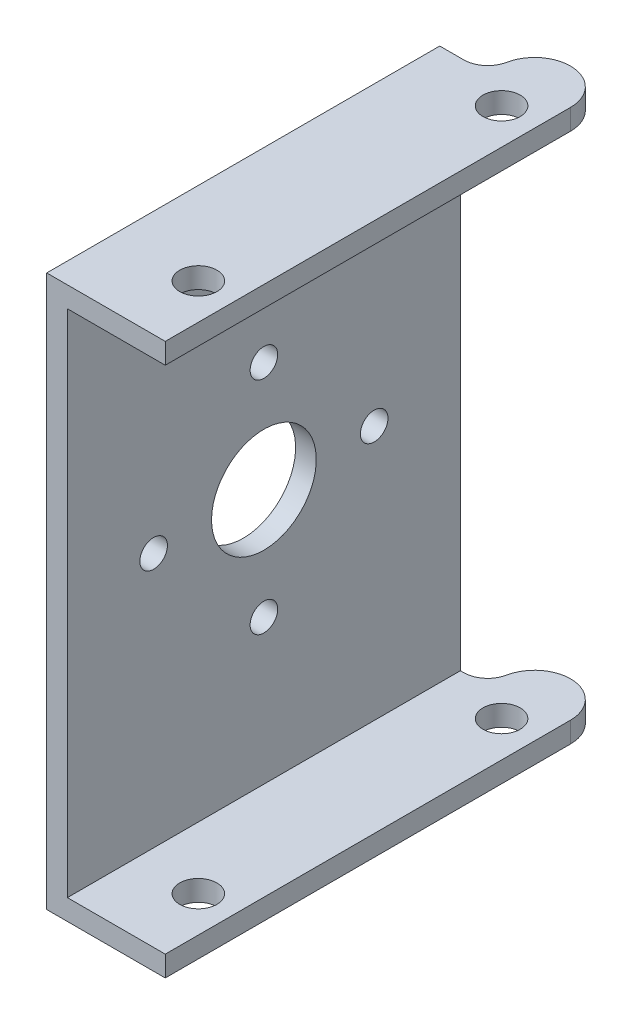
ISO-10303-21;
HEADER;
FILE_DESCRIPTION(('STEP AP214'),'2;1');
FILE_NAME('part.step','',(''),(''),'','','');
FILE_SCHEMA(('AUTOMOTIVE_DESIGN { 1 0 10303 214 1 1 1 1 }'));
ENDSEC;
DATA;
#1=APPLICATION_CONTEXT('core data for automotive mechanical design processes');
#2=APPLICATION_PROTOCOL_DEFINITION('international standard','automotive_design',2000,#1);
#3=PRODUCT_CONTEXT('',#1,'mechanical');
#4=PRODUCT('Part','Part','',(#3));
#5=PRODUCT_RELATED_PRODUCT_CATEGORY('part','',(#4));
#6=PRODUCT_DEFINITION_FORMATION('','',#4);
#7=PRODUCT_DEFINITION_CONTEXT('part definition',#1,'design');
#8=PRODUCT_DEFINITION('design','',#6,#7);
#9=PRODUCT_DEFINITION_SHAPE('','',#8);
#10=(LENGTH_UNIT() NAMED_UNIT(*) SI_UNIT(.MILLI.,.METRE.));
#11=(NAMED_UNIT(*) PLANE_ANGLE_UNIT() SI_UNIT($,.RADIAN.));
#12=(NAMED_UNIT(*) SI_UNIT($,.STERADIAN.) SOLID_ANGLE_UNIT());
#13=UNCERTAINTY_MEASURE_WITH_UNIT(LENGTH_MEASURE(1.E-05),#10,'distance_accuracy_value','');
#14=(GEOMETRIC_REPRESENTATION_CONTEXT(3) GLOBAL_UNCERTAINTY_ASSIGNED_CONTEXT((#13)) GLOBAL_UNIT_ASSIGNED_CONTEXT((#10,
#11,#12)) REPRESENTATION_CONTEXT('',''));
#15=CARTESIAN_POINT('',(0.,0.,0.));
#16=DIRECTION('',(0.,0.,1.));
#17=DIRECTION('',(1.,0.,0.));
#18=AXIS2_PLACEMENT_3D('',#15,#16,#17);
#19=CARTESIAN_POINT('',(8.6,0.,16.));
#20=DIRECTION('',(0.,1.,0.));
#21=DIRECTION('',(-1.,0.,0.));
#22=AXIS2_PLACEMENT_3D('',#19,#20,#21);
#23=PLANE('',#22);
#24=CARTESIAN_POINT('',(6.,0.,11.));
#25=DIRECTION('',(0.,1.,0.));
#26=DIRECTION('',(-1.,0.,0.));
#27=AXIS2_PLACEMENT_3D('',#24,#25,#26);
#28=CIRCLE('',#27,1.35);
#29=CARTESIAN_POINT('',(4.65,0.,11.));
#30=VERTEX_POINT('',#29);
#31=EDGE_CURVE('E162',#30,#30,#28,.T.);
#32=ORIENTED_EDGE('',*,*,#31,.T.);
#33=EDGE_LOOP('',(#32));
#34=FACE_BOUND('',#33,.T.);
#35=CARTESIAN_POINT('',(6.,0.,-11.));
#36=DIRECTION('',(0.,1.,0.));
#37=DIRECTION('',(-1.,0.,0.));
#38=AXIS2_PLACEMENT_3D('',#35,#36,#37);
#39=CIRCLE('',#38,1.35);
#40=CARTESIAN_POINT('',(4.65,0.,-11.));
#41=VERTEX_POINT('',#40);
#42=EDGE_CURVE('E174',#41,#41,#39,.T.);
#43=ORIENTED_EDGE('',*,*,#42,.T.);
#44=EDGE_LOOP('',(#43));
#45=FACE_BOUND('',#44,.T.);
#46=CARTESIAN_POINT('',(6.,0.,-13.4));
#47=DIRECTION('',(0.,1.,0.));
#48=DIRECTION('',(0.,0.,1.));
#49=AXIS2_PLACEMENT_3D('',#46,#47,#48);
#50=CIRCLE('',#49,2.6);
#51=CARTESIAN_POINT('',(8.6,0.,-13.4));
#52=VERTEX_POINT('',#51);
#53=CARTESIAN_POINT('',(3.45116228327821,0.,-13.9132507124364));
#54=VERTEX_POINT('',#53);
#55=EDGE_CURVE('E121',#52,#54,#50,.T.);
#56=ORIENTED_EDGE('',*,*,#55,.F.);
#57=DIRECTION('',(0.,0.,-1.));
#58=VECTOR('',#57,1.);
#59=CARTESIAN_POINT('',(8.6,0.,16.));
#60=LINE('',#59,#58);
#61=CARTESIAN_POINT('',(8.6,0.,16.));
#62=VERTEX_POINT('',#61);
#63=EDGE_CURVE('E11',#62,#52,#60,.T.);
#64=ORIENTED_EDGE('',*,*,#63,.F.);
#65=DIRECTION('',(1.,0.,0.));
#66=VECTOR('',#65,1.);
#67=CARTESIAN_POINT('',(8.6,0.,16.));
#68=LINE('',#67,#66);
#69=CARTESIAN_POINT('',(0.,0.,16.));
#70=VERTEX_POINT('',#69);
#71=EDGE_CURVE('E185',#70,#62,#68,.T.);
#72=ORIENTED_EDGE('',*,*,#71,.F.);
#73=DIRECTION('',(0.,0.,-1.));
#74=VECTOR('',#73,1.);
#75=CARTESIAN_POINT('',(0.,0.,16.));
#76=LINE('',#75,#74);
#77=CARTESIAN_POINT('',(0.,0.,-12.514544668059));
#78=VERTEX_POINT('',#77);
#79=EDGE_CURVE('E125',#70,#78,#76,.T.);
#80=ORIENTED_EDGE('',*,*,#79,.T.);
#81=DIRECTION('',(-1.,0.,0.));
#82=VECTOR('',#81,1.);
#83=CARTESIAN_POINT('',(0.,0.,-12.514544668059));
#84=LINE('',#83,#82);
#85=CARTESIAN_POINT('',(1.74272766597049,0.,-12.514544668059));
#86=VERTEX_POINT('',#85);
#87=EDGE_CURVE('E30',#86,#78,#84,.T.);
#88=ORIENTED_EDGE('',*,*,#87,.F.);
#89=CARTESIAN_POINT('',(1.74272766597049,0.,-14.2572723340295));
#90=DIRECTION('',(0.,1.,0.));
#91=DIRECTION('',(0.,0.,1.));
#92=AXIS2_PLACEMENT_3D('',#89,#90,#91);
#93=CIRCLE('',#92,1.74272766597049);
#94=EDGE_CURVE('E115',#86,#54,#93,.T.);
#95=ORIENTED_EDGE('',*,*,#94,.T.);
#96=EDGE_LOOP('',(#56,#64,#72,#80,#88,#95));
#97=FACE_BOUND('',#96,.T.);
#98=ADVANCED_FACE('F16',(#34,#45,#97),#23,.F.);
#99=CARTESIAN_POINT('',(1.5,1.5,16.));
#100=DIRECTION('',(0.,-1.,0.));
#101=DIRECTION('',(0.,0.,-1.));
#102=AXIS2_PLACEMENT_3D('',#99,#100,#101);
#103=PLANE('',#102);
#104=CARTESIAN_POINT('',(6.,1.5,11.));
#105=DIRECTION('',(0.,-1.,0.));
#106=DIRECTION('',(0.,0.,-1.));
#107=AXIS2_PLACEMENT_3D('',#104,#105,#106);
#108=CIRCLE('',#107,1.35);
#109=CARTESIAN_POINT('',(6.,1.5,9.65));
#110=VERTEX_POINT('',#109);
#111=EDGE_CURVE('E170',#110,#110,#108,.T.);
#112=ORIENTED_EDGE('',*,*,#111,.T.);
#113=EDGE_LOOP('',(#112));
#114=FACE_BOUND('',#113,.T.);
#115=CARTESIAN_POINT('',(6.,1.5,-11.));
#116=DIRECTION('',(0.,-1.,0.));
#117=DIRECTION('',(0.,0.,-1.));
#118=AXIS2_PLACEMENT_3D('',#115,#116,#117);
#119=CIRCLE('',#118,1.35);
#120=CARTESIAN_POINT('',(6.,1.5,-12.35));
#121=VERTEX_POINT('',#120);
#122=EDGE_CURVE('E182',#121,#121,#119,.T.);
#123=ORIENTED_EDGE('',*,*,#122,.T.);
#124=EDGE_LOOP('',(#123));
#125=FACE_BOUND('',#124,.T.);
#126=DIRECTION('',(0.,0.,-1.));
#127=VECTOR('',#126,1.);
#128=CARTESIAN_POINT('',(8.6,1.5,16.));
#129=LINE('',#128,#127);
#130=CARTESIAN_POINT('',(8.6,1.5,16.));
#131=VERTEX_POINT('',#130);
#132=CARTESIAN_POINT('',(8.6,1.5,-13.4));
#133=VERTEX_POINT('',#132);
#134=EDGE_CURVE('E23',#131,#133,#129,.T.);
#135=ORIENTED_EDGE('',*,*,#134,.T.);
#136=CARTESIAN_POINT('',(6.,1.5,-13.4));
#137=DIRECTION('',(0.,-1.,0.));
#138=DIRECTION('',(0.,0.,-1.));
#139=AXIS2_PLACEMENT_3D('',#136,#137,#138);
#140=CIRCLE('',#139,2.6);
#141=CARTESIAN_POINT('',(3.45116228327821,1.5,-13.9132507124364));
#142=VERTEX_POINT('',#141);
#143=EDGE_CURVE('E144',#142,#133,#140,.T.);
#144=ORIENTED_EDGE('',*,*,#143,.F.);
#145=CARTESIAN_POINT('',(1.74272766597049,1.5,-14.2572723340295));
#146=DIRECTION('',(0.,-1.,0.));
#147=DIRECTION('',(0.,0.,-1.));
#148=AXIS2_PLACEMENT_3D('',#145,#146,#147);
#149=CIRCLE('',#148,1.74272766597049);
#150=CARTESIAN_POINT('',(1.74272766597049,1.5,-12.514544668059));
#151=VERTEX_POINT('',#150);
#152=EDGE_CURVE('E159',#142,#151,#149,.T.);
#153=ORIENTED_EDGE('',*,*,#152,.T.);
#154=DIRECTION('',(1.,0.,0.));
#155=VECTOR('',#154,1.);
#156=CARTESIAN_POINT('',(1.49999999999997,1.5,-12.514544668059));
#157=LINE('',#156,#155);
#158=CARTESIAN_POINT('',(1.5,1.5,-12.514544668059));
#159=VERTEX_POINT('',#158);
#160=EDGE_CURVE('E107',#159,#151,#157,.T.);
#161=ORIENTED_EDGE('',*,*,#160,.F.);
#162=DIRECTION('',(0.,0.,-1.));
#163=VECTOR('',#162,1.);
#164=CARTESIAN_POINT('',(1.5,1.5,16.));
#165=LINE('',#164,#163);
#166=CARTESIAN_POINT('',(1.5,1.5,16.));
#167=VERTEX_POINT('',#166);
#168=EDGE_CURVE('E213',#167,#159,#165,.T.);
#169=ORIENTED_EDGE('',*,*,#168,.F.);
#170=DIRECTION('',(-1.,0.,0.));
#171=VECTOR('',#170,1.);
#172=CARTESIAN_POINT('',(1.5,1.5,16.));
#173=LINE('',#172,#171);
#174=EDGE_CURVE('E189',#131,#167,#173,.T.);
#175=ORIENTED_EDGE('',*,*,#174,.F.);
#176=EDGE_LOOP('',(#135,#144,#153,#161,#169,#175));
#177=FACE_BOUND('',#176,.T.);
#178=ADVANCED_FACE('F220',(#114,#125,#177),#103,.F.);
#179=CARTESIAN_POINT('',(1.5,38.5,16.));
#180=DIRECTION('',(-1.,0.,0.));
#181=DIRECTION('',(0.,-1.,0.));
#182=AXIS2_PLACEMENT_3D('',#179,#180,#181);
#183=PLANE('',#182);
#184=CARTESIAN_POINT('',(1.5,20.,9.74272766597049));
#185=DIRECTION('',(1.,0.,0.));
#186=DIRECTION('',(0.,0.,1.));
#187=AXIS2_PLACEMENT_3D('',#184,#185,#186);
#188=CIRCLE('',#187,1.);
#189=CARTESIAN_POINT('',(1.5,20.,10.7427276659705));
#190=VERTEX_POINT('',#189);
#191=EDGE_CURVE('E448',#190,#190,#188,.T.);
#192=ORIENTED_EDGE('',*,*,#191,.F.);
#193=EDGE_LOOP('',(#192));
#194=FACE_BOUND('',#193,.T.);
#195=CARTESIAN_POINT('',(1.5,12.,1.74272766597049));
#196=DIRECTION('',(1.,0.,0.));
#197=DIRECTION('',(0.,-1.,0.));
#198=AXIS2_PLACEMENT_3D('',#195,#196,#197);
#199=CIRCLE('',#198,1.);
#200=CARTESIAN_POINT('',(1.5,11.,1.74272766597049));
#201=VERTEX_POINT('',#200);
#202=EDGE_CURVE('E450',#201,#201,#199,.T.);
#203=ORIENTED_EDGE('',*,*,#202,.F.);
#204=EDGE_LOOP('',(#203));
#205=FACE_BOUND('',#204,.T.);
#206=CARTESIAN_POINT('',(1.5,20.,-6.25727233402951));
#207=DIRECTION('',(1.,0.,0.));
#208=DIRECTION('',(0.,0.,-1.));
#209=AXIS2_PLACEMENT_3D('',#206,#207,#208);
#210=CIRCLE('',#209,1.);
#211=CARTESIAN_POINT('',(1.5,20.,-7.25727233402951));
#212=VERTEX_POINT('',#211);
#213=EDGE_CURVE('E456',#212,#212,#210,.T.);
#214=ORIENTED_EDGE('',*,*,#213,.F.);
#215=EDGE_LOOP('',(#214));
#216=FACE_BOUND('',#215,.T.);
#217=CARTESIAN_POINT('',(1.5,28.,1.74272766597049));
#218=DIRECTION('',(1.,0.,0.));
#219=DIRECTION('',(0.,1.,0.));
#220=AXIS2_PLACEMENT_3D('',#217,#218,#219);
#221=CIRCLE('',#220,1.);
#222=CARTESIAN_POINT('',(1.5,29.,1.74272766597049));
#223=VERTEX_POINT('',#222);
#224=EDGE_CURVE('E462',#223,#223,#221,.T.);
#225=ORIENTED_EDGE('',*,*,#224,.F.);
#226=EDGE_LOOP('',(#225));
#227=FACE_BOUND('',#226,.T.);
#228=CARTESIAN_POINT('',(1.5,20.,1.74272766597049));
#229=DIRECTION('',(-1.,0.,0.));
#230=DIRECTION('',(0.,-1.,0.));
#231=AXIS2_PLACEMENT_3D('',#228,#229,#230);
#232=CIRCLE('',#231,3.8);
#233=CARTESIAN_POINT('',(1.5,16.2,1.74272766597049));
#234=VERTEX_POINT('',#233);
#235=EDGE_CURVE('E131',#234,#234,#232,.T.);
#236=ORIENTED_EDGE('',*,*,#235,.T.);
#237=EDGE_LOOP('',(#236));
#238=FACE_BOUND('',#237,.T.);
#239=DIRECTION('',(0.,-1.,0.));
#240=VECTOR('',#239,1.);
#241=CARTESIAN_POINT('',(1.5,38.5,-12.514544668059));
#242=LINE('',#241,#240);
#243=CARTESIAN_POINT('',(1.5,38.5,-12.514544668059));
#244=VERTEX_POINT('',#243);
#245=EDGE_CURVE('E153',#244,#159,#242,.T.);
#246=ORIENTED_EDGE('',*,*,#245,.F.);
#247=DIRECTION('',(0.,0.,-1.));
#248=VECTOR('',#247,1.);
#249=CARTESIAN_POINT('',(1.5,38.5,16.));
#250=LINE('',#249,#248);
#251=CARTESIAN_POINT('',(1.5,38.5,16.));
#252=VERTEX_POINT('',#251);
#253=EDGE_CURVE('E210',#252,#244,#250,.T.);
#254=ORIENTED_EDGE('',*,*,#253,.F.);
#255=DIRECTION('',(0.,1.,0.));
#256=VECTOR('',#255,1.);
#257=CARTESIAN_POINT('',(1.5,38.5,16.));
#258=LINE('',#257,#256);
#259=EDGE_CURVE('E191',#167,#252,#258,.T.);
#260=ORIENTED_EDGE('',*,*,#259,.F.);
#261=ORIENTED_EDGE('',*,*,#168,.T.);
#262=EDGE_LOOP('',(#246,#254,#260,#261));
#263=FACE_BOUND('',#262,.T.);
#264=ADVANCED_FACE('F232',(#194,#205,#216,#227,#238,#263),#183,.F.);
#265=CARTESIAN_POINT('',(8.6,38.5,16.));
#266=DIRECTION('',(0.,1.,0.));
#267=DIRECTION('',(0.,0.,1.));
#268=AXIS2_PLACEMENT_3D('',#265,#266,#267);
#269=PLANE('',#268);
#270=CARTESIAN_POINT('',(6.,38.5,11.));
#271=DIRECTION('',(0.,1.,0.));
#272=DIRECTION('',(0.,0.,1.));
#273=AXIS2_PLACEMENT_3D('',#270,#271,#272);
#274=CIRCLE('',#273,1.35);
#275=CARTESIAN_POINT('',(6.,38.5,12.35));
#276=VERTEX_POINT('',#275);
#277=EDGE_CURVE('E165',#276,#276,#274,.T.);
#278=ORIENTED_EDGE('',*,*,#277,.T.);
#279=EDGE_LOOP('',(#278));
#280=FACE_BOUND('',#279,.T.);
#281=CARTESIAN_POINT('',(6.,38.5,-11.));
#282=DIRECTION('',(0.,1.,0.));
#283=DIRECTION('',(0.,0.,1.));
#284=AXIS2_PLACEMENT_3D('',#281,#282,#283);
#285=CIRCLE('',#284,1.35);
#286=CARTESIAN_POINT('',(6.,38.5,-9.65));
#287=VERTEX_POINT('',#286);
#288=EDGE_CURVE('E177',#287,#287,#285,.T.);
#289=ORIENTED_EDGE('',*,*,#288,.T.);
#290=EDGE_LOOP('',(#289));
#291=FACE_BOUND('',#290,.T.);
#292=CARTESIAN_POINT('',(6.,38.5,-13.4));
#293=DIRECTION('',(0.,1.,0.));
#294=DIRECTION('',(0.,0.,1.));
#295=AXIS2_PLACEMENT_3D('',#292,#293,#294);
#296=CIRCLE('',#295,2.6);
#297=CARTESIAN_POINT('',(8.6,38.5,-13.4));
#298=VERTEX_POINT('',#297);
#299=CARTESIAN_POINT('',(3.45116228327821,38.5,-13.9132507124364));
#300=VERTEX_POINT('',#299);
#301=EDGE_CURVE('E148',#298,#300,#296,.T.);
#302=ORIENTED_EDGE('',*,*,#301,.F.);
#303=DIRECTION('',(0.,0.,-1.));
#304=VECTOR('',#303,1.);
#305=CARTESIAN_POINT('',(8.6,38.5,16.));
#306=LINE('',#305,#304);
#307=CARTESIAN_POINT('',(8.6,38.5,16.));
#308=VERTEX_POINT('',#307);
#309=EDGE_CURVE('E207',#308,#298,#306,.T.);
#310=ORIENTED_EDGE('',*,*,#309,.F.);
#311=DIRECTION('',(1.,0.,0.));
#312=VECTOR('',#311,1.);
#313=CARTESIAN_POINT('',(8.6,38.5,16.));
#314=LINE('',#313,#312);
#315=EDGE_CURVE('E193',#252,#308,#314,.T.);
#316=ORIENTED_EDGE('',*,*,#315,.F.);
#317=ORIENTED_EDGE('',*,*,#253,.T.);
#318=DIRECTION('',(-1.,0.,0.));
#319=VECTOR('',#318,1.);
#320=CARTESIAN_POINT('',(8.6,38.5,-12.514544668059));
#321=LINE('',#320,#319);
#322=CARTESIAN_POINT('',(1.74272766597049,38.5,-12.514544668059));
#323=VERTEX_POINT('',#322);
#324=EDGE_CURVE('E150',#323,#244,#321,.T.);
#325=ORIENTED_EDGE('',*,*,#324,.F.);
#326=CARTESIAN_POINT('',(1.74272766597049,38.5,-14.2572723340295));
#327=DIRECTION('',(0.,1.,0.));
#328=DIRECTION('',(0.,0.,1.));
#329=AXIS2_PLACEMENT_3D('',#326,#327,#328);
#330=CIRCLE('',#329,1.74272766597049);
#331=EDGE_CURVE('E156',#323,#300,#330,.T.);
#332=ORIENTED_EDGE('',*,*,#331,.T.);
#333=EDGE_LOOP('',(#302,#310,#316,#317,#325,#332));
#334=FACE_BOUND('',#333,.T.);
#335=ADVANCED_FACE('F238',(#280,#291,#334),#269,.F.);
#336=CARTESIAN_POINT('',(0.,40.,16.));
#337=DIRECTION('',(0.,-1.,0.));
#338=DIRECTION('',(0.,0.,-1.));
#339=AXIS2_PLACEMENT_3D('',#336,#337,#338);
#340=PLANE('',#339);
#341=CARTESIAN_POINT('',(6.,40.,11.));
#342=DIRECTION('',(0.,1.,0.));
#343=DIRECTION('',(-1.,0.,0.));
#344=AXIS2_PLACEMENT_3D('',#341,#342,#343);
#345=CIRCLE('',#344,1.35);
#346=CARTESIAN_POINT('',(4.65,40.,11.));
#347=VERTEX_POINT('',#346);
#348=EDGE_CURVE('E161',#347,#347,#345,.T.);
#349=ORIENTED_EDGE('',*,*,#348,.F.);
#350=EDGE_LOOP('',(#349));
#351=FACE_BOUND('',#350,.T.);
#352=CARTESIAN_POINT('',(6.,40.,-11.));
#353=DIRECTION('',(0.,1.,0.));
#354=DIRECTION('',(-1.,0.,0.));
#355=AXIS2_PLACEMENT_3D('',#352,#353,#354);
#356=CIRCLE('',#355,1.35);
#357=CARTESIAN_POINT('',(4.65,40.,-11.));
#358=VERTEX_POINT('',#357);
#359=EDGE_CURVE('E173',#358,#358,#356,.T.);
#360=ORIENTED_EDGE('',*,*,#359,.F.);
#361=EDGE_LOOP('',(#360));
#362=FACE_BOUND('',#361,.T.);
#363=CARTESIAN_POINT('',(6.,40.,-13.4));
#364=DIRECTION('',(0.,1.,0.));
#365=DIRECTION('',(0.,0.,1.));
#366=AXIS2_PLACEMENT_3D('',#363,#364,#365);
#367=CIRCLE('',#366,2.6);
#368=CARTESIAN_POINT('',(8.6,40.,-13.4));
#369=VERTEX_POINT('',#368);
#370=CARTESIAN_POINT('',(3.45116228327821,40.,-13.9132507124364));
#371=VERTEX_POINT('',#370);
#372=EDGE_CURVE('E126',#369,#371,#367,.T.);
#373=ORIENTED_EDGE('',*,*,#372,.T.);
#374=CARTESIAN_POINT('',(1.74272766597049,40.,-14.2572723340295));
#375=DIRECTION('',(0.,1.,0.));
#376=DIRECTION('',(0.,0.,1.));
#377=AXIS2_PLACEMENT_3D('',#374,#375,#376);
#378=CIRCLE('',#377,1.74272766597049);
#379=CARTESIAN_POINT('',(1.74272766597049,40.,-12.514544668059));
#380=VERTEX_POINT('',#379);
#381=EDGE_CURVE('E128',#380,#371,#378,.T.);
#382=ORIENTED_EDGE('',*,*,#381,.F.);
#383=DIRECTION('',(-1.,0.,0.));
#384=VECTOR('',#383,1.);
#385=CARTESIAN_POINT('',(0.,40.,-12.514544668059));
#386=LINE('',#385,#384);
#387=CARTESIAN_POINT('',(0.,40.,-12.514544668059));
#388=VERTEX_POINT('',#387);
#389=EDGE_CURVE('E136',#380,#388,#386,.T.);
#390=ORIENTED_EDGE('',*,*,#389,.T.);
#391=DIRECTION('',(0.,0.,-1.));
#392=VECTOR('',#391,1.);
#393=CARTESIAN_POINT('',(0.,40.,16.));
#394=LINE('',#393,#392);
#395=CARTESIAN_POINT('',(0.,40.,16.));
#396=VERTEX_POINT('',#395);
#397=EDGE_CURVE('E201',#396,#388,#394,.T.);
#398=ORIENTED_EDGE('',*,*,#397,.F.);
#399=DIRECTION('',(-1.,0.,0.));
#400=VECTOR('',#399,1.);
#401=CARTESIAN_POINT('',(0.,40.,16.));
#402=LINE('',#401,#400);
#403=CARTESIAN_POINT('',(8.6,40.,16.));
#404=VERTEX_POINT('',#403);
#405=EDGE_CURVE('E197',#404,#396,#402,.T.);
#406=ORIENTED_EDGE('',*,*,#405,.F.);
#407=DIRECTION('',(0.,0.,-1.));
#408=VECTOR('',#407,1.);
#409=CARTESIAN_POINT('',(8.6,40.,16.));
#410=LINE('',#409,#408);
#411=EDGE_CURVE('E204',#404,#369,#410,.T.);
#412=ORIENTED_EDGE('',*,*,#411,.T.);
#413=EDGE_LOOP('',(#373,#382,#390,#398,#406,#412));
#414=FACE_BOUND('',#413,.T.);
#415=ADVANCED_FACE('F247',(#351,#362,#414),#340,.F.);
#416=CARTESIAN_POINT('',(0.,0.,16.));
#417=DIRECTION('',(1.,0.,0.));
#418=DIRECTION('',(0.,0.,-1.));
#419=AXIS2_PLACEMENT_3D('',#416,#417,#418);
#420=PLANE('',#419);
#421=CARTESIAN_POINT('',(0.,20.,9.74272766597049));
#422=DIRECTION('',(1.,0.,0.));
#423=DIRECTION('',(0.,0.,1.));
#424=AXIS2_PLACEMENT_3D('',#421,#422,#423);
#425=CIRCLE('',#424,1.);
#426=CARTESIAN_POINT('',(0.,20.,10.7427276659705));
#427=VERTEX_POINT('',#426);
#428=EDGE_CURVE('E445',#427,#427,#425,.T.);
#429=ORIENTED_EDGE('',*,*,#428,.T.);
#430=EDGE_LOOP('',(#429));
#431=FACE_BOUND('',#430,.T.);
#432=CARTESIAN_POINT('',(0.,12.,1.74272766597049));
#433=DIRECTION('',(1.,0.,0.));
#434=DIRECTION('',(0.,-1.,0.));
#435=AXIS2_PLACEMENT_3D('',#432,#433,#434);
#436=CIRCLE('',#435,1.);
#437=CARTESIAN_POINT('',(0.,11.,1.74272766597049));
#438=VERTEX_POINT('',#437);
#439=EDGE_CURVE('E453',#438,#438,#436,.T.);
#440=ORIENTED_EDGE('',*,*,#439,.T.);
#441=EDGE_LOOP('',(#440));
#442=FACE_BOUND('',#441,.T.);
#443=CARTESIAN_POINT('',(0.,20.,-6.25727233402951));
#444=DIRECTION('',(1.,0.,0.));
#445=DIRECTION('',(0.,0.,-1.));
#446=AXIS2_PLACEMENT_3D('',#443,#444,#445);
#447=CIRCLE('',#446,1.);
#448=CARTESIAN_POINT('',(0.,20.,-7.25727233402951));
#449=VERTEX_POINT('',#448);
#450=EDGE_CURVE('E459',#449,#449,#447,.T.);
#451=ORIENTED_EDGE('',*,*,#450,.T.);
#452=EDGE_LOOP('',(#451));
#453=FACE_BOUND('',#452,.T.);
#454=CARTESIAN_POINT('',(0.,28.,1.74272766597049));
#455=DIRECTION('',(1.,0.,0.));
#456=DIRECTION('',(0.,1.,0.));
#457=AXIS2_PLACEMENT_3D('',#454,#455,#456);
#458=CIRCLE('',#457,1.);
#459=CARTESIAN_POINT('',(0.,29.,1.74272766597049));
#460=VERTEX_POINT('',#459);
#461=EDGE_CURVE('E465',#460,#460,#458,.T.);
#462=ORIENTED_EDGE('',*,*,#461,.T.);
#463=EDGE_LOOP('',(#462));
#464=FACE_BOUND('',#463,.T.);
#465=CARTESIAN_POINT('',(0.,20.,1.74272766597049));
#466=DIRECTION('',(-1.,0.,0.));
#467=DIRECTION('',(0.,0.,1.));
#468=AXIS2_PLACEMENT_3D('',#465,#466,#467);
#469=CIRCLE('',#468,3.8);
#470=CARTESIAN_POINT('',(0.,20.,5.54272766597049));
#471=VERTEX_POINT('',#470);
#472=EDGE_CURVE('E468',#471,#471,#469,.T.);
#473=ORIENTED_EDGE('',*,*,#472,.F.);
#474=EDGE_LOOP('',(#473));
#475=FACE_BOUND('',#474,.T.);
#476=DIRECTION('',(0.,1.,0.));
#477=VECTOR('',#476,1.);
#478=CARTESIAN_POINT('',(0.,0.,-12.514544668059));
#479=LINE('',#478,#477);
#480=EDGE_CURVE('E135',#78,#388,#479,.T.);
#481=ORIENTED_EDGE('',*,*,#480,.F.);
#482=ORIENTED_EDGE('',*,*,#79,.F.);
#483=DIRECTION('',(0.,-1.,0.));
#484=VECTOR('',#483,1.);
#485=CARTESIAN_POINT('',(0.,0.,16.));
#486=LINE('',#485,#484);
#487=EDGE_CURVE('E38',#396,#70,#486,.T.);
#488=ORIENTED_EDGE('',*,*,#487,.F.);
#489=ORIENTED_EDGE('',*,*,#397,.T.);
#490=EDGE_LOOP('',(#481,#482,#488,#489));
#491=FACE_BOUND('',#490,.T.);
#492=ADVANCED_FACE('F251',(#431,#442,#453,#464,#475,#491),#420,.F.);
#493=CARTESIAN_POINT('',(8.6,1.5,16.));
#494=DIRECTION('',(-1.,0.,0.));
#495=DIRECTION('',(0.,0.,1.));
#496=AXIS2_PLACEMENT_3D('',#493,#494,#495);
#497=PLANE('',#496);
#498=ORIENTED_EDGE('',*,*,#63,.T.);
#499=DIRECTION('',(0.,1.,0.));
#500=VECTOR('',#499,1.);
#501=CARTESIAN_POINT('',(8.6,0.,-13.4));
#502=LINE('',#501,#500);
#503=EDGE_CURVE('E141',#52,#133,#502,.T.);
#504=ORIENTED_EDGE('',*,*,#503,.T.);
#505=ORIENTED_EDGE('',*,*,#134,.F.);
#506=DIRECTION('',(0.,1.,0.));
#507=VECTOR('',#506,1.);
#508=CARTESIAN_POINT('',(8.6,1.5,16.));
#509=LINE('',#508,#507);
#510=EDGE_CURVE('E187',#62,#131,#509,.T.);
#511=ORIENTED_EDGE('',*,*,#510,.F.);
#512=EDGE_LOOP('',(#498,#504,#505,#511));
#513=FACE_BOUND('',#512,.T.);
#514=ADVANCED_FACE('F223',(#513),#497,.F.);
#515=CARTESIAN_POINT('',(8.6,40.,16.));
#516=DIRECTION('',(-1.,0.,0.));
#517=DIRECTION('',(0.,0.,1.));
#518=AXIS2_PLACEMENT_3D('',#515,#516,#517);
#519=PLANE('',#518);
#520=ORIENTED_EDGE('',*,*,#309,.T.);
#521=EDGE_CURVE('E145',#298,#369,#502,.T.);
#522=ORIENTED_EDGE('',*,*,#521,.T.);
#523=ORIENTED_EDGE('',*,*,#411,.F.);
#524=DIRECTION('',(0.,1.,0.));
#525=VECTOR('',#524,1.);
#526=CARTESIAN_POINT('',(8.6,40.,16.));
#527=LINE('',#526,#525);
#528=EDGE_CURVE('E195',#308,#404,#527,.T.);
#529=ORIENTED_EDGE('',*,*,#528,.F.);
#530=EDGE_LOOP('',(#520,#522,#523,#529));
#531=FACE_BOUND('',#530,.T.);
#532=ADVANCED_FACE('F245',(#531),#519,.F.);
#533=CARTESIAN_POINT('',(0.,0.,16.));
#534=DIRECTION('',(0.,0.,-1.));
#535=DIRECTION('',(-1.,0.,0.));
#536=AXIS2_PLACEMENT_3D('',#533,#534,#535);
#537=PLANE('',#536);
#538=ORIENTED_EDGE('',*,*,#71,.T.);
#539=ORIENTED_EDGE('',*,*,#510,.T.);
#540=ORIENTED_EDGE('',*,*,#174,.T.);
#541=ORIENTED_EDGE('',*,*,#259,.T.);
#542=ORIENTED_EDGE('',*,*,#315,.T.);
#543=ORIENTED_EDGE('',*,*,#528,.T.);
#544=ORIENTED_EDGE('',*,*,#405,.T.);
#545=ORIENTED_EDGE('',*,*,#487,.T.);
#546=EDGE_LOOP('',(#538,#539,#540,#541,#542,#543,#544,#545));
#547=FACE_BOUND('',#546,.T.);
#548=ADVANCED_FACE('F227',(#547),#537,.F.);
#549=CARTESIAN_POINT('',(6.,0.,-11.));
#550=DIRECTION('',(0.,1.,0.));
#551=DIRECTION('',(-1.,0.,0.));
#552=AXIS2_PLACEMENT_3D('',#549,#550,#551);
#553=CYLINDRICAL_SURFACE('',#552,1.35);
#554=ORIENTED_EDGE('',*,*,#359,.T.);
#555=EDGE_LOOP('',(#554));
#556=FACE_BOUND('',#555,.T.);
#557=ORIENTED_EDGE('',*,*,#288,.F.);
#558=EDGE_LOOP('',(#557));
#559=FACE_BOUND('',#558,.T.);
#560=ADVANCED_FACE('F286',(#556,#559),#553,.F.);
#561=ORIENTED_EDGE('',*,*,#42,.F.);
#562=EDGE_LOOP('',(#561));
#563=FACE_BOUND('',#562,.T.);
#564=ORIENTED_EDGE('',*,*,#122,.F.);
#565=EDGE_LOOP('',(#564));
#566=FACE_BOUND('',#565,.T.);
#567=ADVANCED_FACE('F282',(#563,#566),#553,.F.);
#568=CARTESIAN_POINT('',(6.,0.,11.));
#569=DIRECTION('',(0.,1.,0.));
#570=DIRECTION('',(-1.,0.,0.));
#571=AXIS2_PLACEMENT_3D('',#568,#569,#570);
#572=CYLINDRICAL_SURFACE('',#571,1.35);
#573=ORIENTED_EDGE('',*,*,#348,.T.);
#574=EDGE_LOOP('',(#573));
#575=FACE_BOUND('',#574,.T.);
#576=ORIENTED_EDGE('',*,*,#277,.F.);
#577=EDGE_LOOP('',(#576));
#578=FACE_BOUND('',#577,.T.);
#579=ADVANCED_FACE('F285',(#575,#578),#572,.F.);
#580=ORIENTED_EDGE('',*,*,#31,.F.);
#581=EDGE_LOOP('',(#580));
#582=FACE_BOUND('',#581,.T.);
#583=ORIENTED_EDGE('',*,*,#111,.F.);
#584=EDGE_LOOP('',(#583));
#585=FACE_BOUND('',#584,.T.);
#586=ADVANCED_FACE('F294',(#582,#585),#572,.F.);
#587=CARTESIAN_POINT('',(1.74272766597049,0.,-14.2572723340295));
#588=DIRECTION('',(0.,1.,0.));
#589=DIRECTION('',(0.,0.,1.));
#590=AXIS2_PLACEMENT_3D('',#587,#588,#589);
#591=CYLINDRICAL_SURFACE('',#590,1.74272766597049);
#592=DIRECTION('',(0.,1.,0.));
#593=VECTOR('',#592,1.);
#594=CARTESIAN_POINT('',(3.45116228327821,0.,-13.9132507124364));
#595=LINE('',#594,#593);
#596=EDGE_CURVE('E118',#54,#142,#595,.T.);
#597=ORIENTED_EDGE('',*,*,#596,.F.);
#598=ORIENTED_EDGE('',*,*,#94,.F.);
#599=DIRECTION('',(0.,1.,0.));
#600=VECTOR('',#599,1.);
#601=CARTESIAN_POINT('',(1.74272766597049,0.,-12.514544668059));
#602=LINE('',#601,#600);
#603=EDGE_CURVE('E103',#86,#151,#602,.T.);
#604=ORIENTED_EDGE('',*,*,#603,.T.);
#605=ORIENTED_EDGE('',*,*,#152,.F.);
#606=EDGE_LOOP('',(#597,#598,#604,#605));
#607=FACE_BOUND('',#606,.T.);
#608=ADVANCED_FACE('F116',(#607),#591,.F.);
#609=EDGE_CURVE('E111',#323,#380,#602,.T.);
#610=ORIENTED_EDGE('',*,*,#609,.T.);
#611=ORIENTED_EDGE('',*,*,#381,.T.);
#612=EDGE_CURVE('E110',#300,#371,#595,.T.);
#613=ORIENTED_EDGE('',*,*,#612,.F.);
#614=ORIENTED_EDGE('',*,*,#331,.F.);
#615=EDGE_LOOP('',(#610,#611,#613,#614));
#616=FACE_BOUND('',#615,.T.);
#617=ADVANCED_FACE('F256',(#616),#591,.F.);
#618=CARTESIAN_POINT('',(0.,0.,-12.514544668059));
#619=DIRECTION('',(0.,0.,-1.));
#620=DIRECTION('',(-1.,0.,0.));
#621=AXIS2_PLACEMENT_3D('',#618,#619,#620);
#622=PLANE('',#621);
#623=ORIENTED_EDGE('',*,*,#160,.T.);
#624=ORIENTED_EDGE('',*,*,#603,.F.);
#625=ORIENTED_EDGE('',*,*,#87,.T.);
#626=ORIENTED_EDGE('',*,*,#480,.T.);
#627=ORIENTED_EDGE('',*,*,#389,.F.);
#628=ORIENTED_EDGE('',*,*,#609,.F.);
#629=ORIENTED_EDGE('',*,*,#324,.T.);
#630=ORIENTED_EDGE('',*,*,#245,.T.);
#631=EDGE_LOOP('',(#623,#624,#625,#626,#627,#628,#629,#630));
#632=FACE_BOUND('',#631,.T.);
#633=ADVANCED_FACE('F105',(#632),#622,.T.);
#634=CARTESIAN_POINT('',(6.,0.,-13.4));
#635=DIRECTION('',(0.,1.,0.));
#636=DIRECTION('',(0.,0.,1.));
#637=AXIS2_PLACEMENT_3D('',#634,#635,#636);
#638=CYLINDRICAL_SURFACE('',#637,2.6);
#639=ORIENTED_EDGE('',*,*,#143,.T.);
#640=ORIENTED_EDGE('',*,*,#503,.F.);
#641=ORIENTED_EDGE('',*,*,#55,.T.);
#642=ORIENTED_EDGE('',*,*,#596,.T.);
#643=EDGE_LOOP('',(#639,#640,#641,#642));
#644=FACE_BOUND('',#643,.T.);
#645=ADVANCED_FACE('F226',(#644),#638,.T.);
#646=ORIENTED_EDGE('',*,*,#301,.T.);
#647=ORIENTED_EDGE('',*,*,#612,.T.);
#648=ORIENTED_EDGE('',*,*,#372,.F.);
#649=ORIENTED_EDGE('',*,*,#521,.F.);
#650=EDGE_LOOP('',(#646,#647,#648,#649));
#651=FACE_BOUND('',#650,.T.);
#652=ADVANCED_FACE('F258',(#651),#638,.T.);
#653=CARTESIAN_POINT('',(8.6,20.,1.74272766597049));
#654=DIRECTION('',(-1.,0.,0.));
#655=DIRECTION('',(0.,0.,1.));
#656=AXIS2_PLACEMENT_3D('',#653,#654,#655);
#657=CYLINDRICAL_SURFACE('',#656,3.8);
#658=ORIENTED_EDGE('',*,*,#472,.T.);
#659=EDGE_LOOP('',(#658));
#660=FACE_BOUND('',#659,.T.);
#661=ORIENTED_EDGE('',*,*,#235,.F.);
#662=EDGE_LOOP('',(#661));
#663=FACE_BOUND('',#662,.T.);
#664=ADVANCED_FACE('F260',(#660,#663),#657,.F.);
#665=CARTESIAN_POINT('',(0.,28.,1.74272766597049));
#666=DIRECTION('',(1.,0.,0.));
#667=DIRECTION('',(0.,1.,0.));
#668=AXIS2_PLACEMENT_3D('',#665,#666,#667);
#669=CYLINDRICAL_SURFACE('',#668,1.);
#670=ORIENTED_EDGE('',*,*,#461,.F.);
#671=EDGE_LOOP('',(#670));
#672=FACE_BOUND('',#671,.T.);
#673=ORIENTED_EDGE('',*,*,#224,.T.);
#674=EDGE_LOOP('',(#673));
#675=FACE_BOUND('',#674,.T.);
#676=ADVANCED_FACE('F267',(#672,#675),#669,.F.);
#677=CARTESIAN_POINT('',(0.,20.,-6.25727233402951));
#678=DIRECTION('',(1.,0.,0.));
#679=DIRECTION('',(0.,1.,0.));
#680=AXIS2_PLACEMENT_3D('',#677,#678,#679);
#681=CYLINDRICAL_SURFACE('',#680,1.);
#682=ORIENTED_EDGE('',*,*,#450,.F.);
#683=EDGE_LOOP('',(#682));
#684=FACE_BOUND('',#683,.T.);
#685=ORIENTED_EDGE('',*,*,#213,.T.);
#686=EDGE_LOOP('',(#685));
#687=FACE_BOUND('',#686,.T.);
#688=ADVANCED_FACE('F408',(#684,#687),#681,.F.);
#689=CARTESIAN_POINT('',(0.,12.,1.74272766597049));
#690=DIRECTION('',(1.,0.,0.));
#691=DIRECTION('',(0.,1.,0.));
#692=AXIS2_PLACEMENT_3D('',#689,#690,#691);
#693=CYLINDRICAL_SURFACE('',#692,1.);
#694=ORIENTED_EDGE('',*,*,#439,.F.);
#695=EDGE_LOOP('',(#694));
#696=FACE_BOUND('',#695,.T.);
#697=ORIENTED_EDGE('',*,*,#202,.T.);
#698=EDGE_LOOP('',(#697));
#699=FACE_BOUND('',#698,.T.);
#700=ADVANCED_FACE('F418',(#696,#699),#693,.F.);
#701=CARTESIAN_POINT('',(0.,20.,9.74272766597049));
#702=DIRECTION('',(1.,0.,0.));
#703=DIRECTION('',(0.,1.,0.));
#704=AXIS2_PLACEMENT_3D('',#701,#702,#703);
#705=CYLINDRICAL_SURFACE('',#704,1.);
#706=ORIENTED_EDGE('',*,*,#428,.F.);
#707=EDGE_LOOP('',(#706));
#708=FACE_BOUND('',#707,.T.);
#709=ORIENTED_EDGE('',*,*,#191,.T.);
#710=EDGE_LOOP('',(#709));
#711=FACE_BOUND('',#710,.T.);
#712=ADVANCED_FACE('F428',(#708,#711),#705,.F.);
#713=CLOSED_SHELL('',(#98,#178,#264,#335,#415,#492,#514,#532,#548,#560,#567,#579,#586,#608,#617,
#633,#645,#652,#664,#676,#688,#700,#712));
#714=MANIFOLD_SOLID_BREP('B1',#713);
#715=ADVANCED_BREP_SHAPE_REPRESENTATION('',(#18,#714),#14);
#716=SHAPE_DEFINITION_REPRESENTATION(#9,#715);
ENDSEC;
END-ISO-10303-21;
